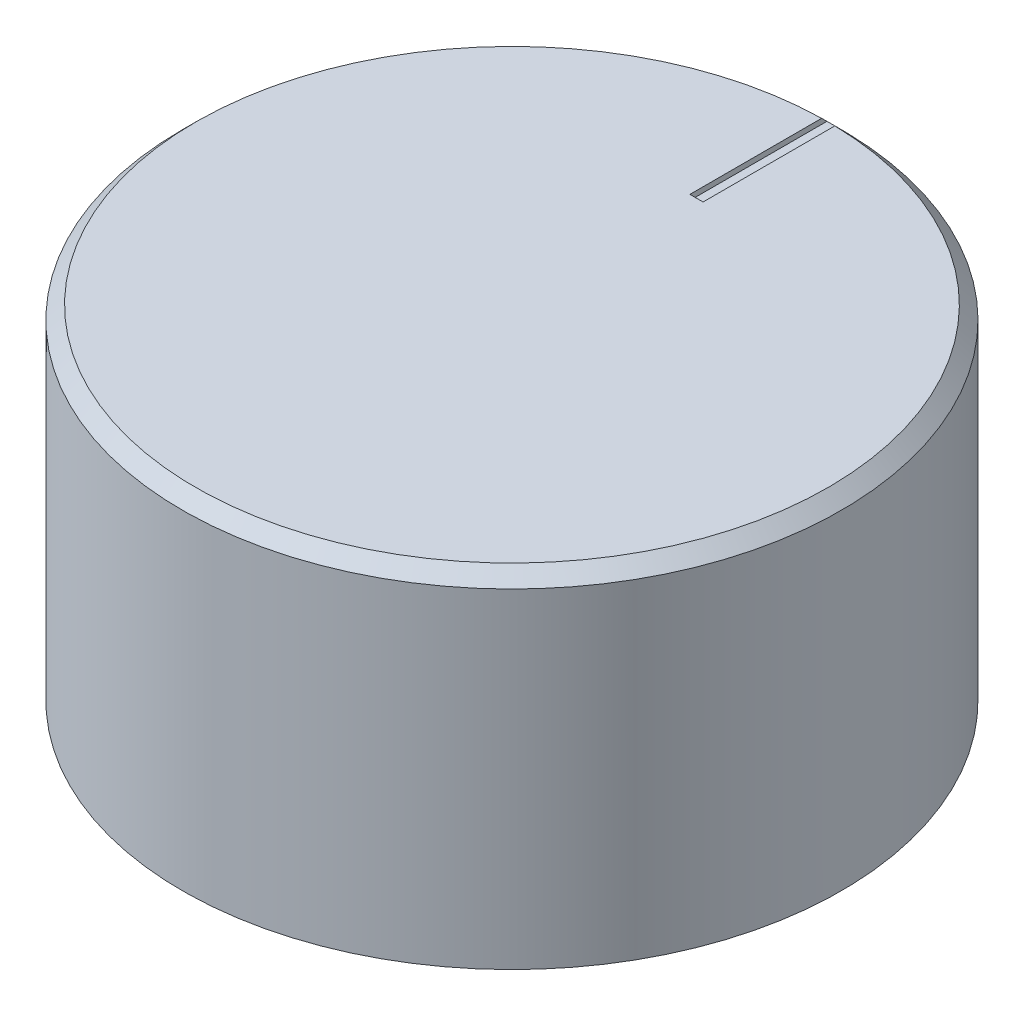
ISO-10303-21;
HEADER;
FILE_DESCRIPTION(('STEP AP214'),'2;1');
FILE_NAME('part.step','',(''),(''),'','','');
FILE_SCHEMA(('AUTOMOTIVE_DESIGN { 1 0 10303 214 1 1 1 1 }'));
ENDSEC;
DATA;
#1=APPLICATION_CONTEXT('core data for automotive mechanical design processes');
#2=APPLICATION_PROTOCOL_DEFINITION('international standard','automotive_design',2000,#1);
#3=PRODUCT_CONTEXT('',#1,'mechanical');
#4=PRODUCT('Part','Part','',(#3));
#5=PRODUCT_RELATED_PRODUCT_CATEGORY('part','',(#4));
#6=PRODUCT_DEFINITION_FORMATION('','',#4);
#7=PRODUCT_DEFINITION_CONTEXT('part definition',#1,'design');
#8=PRODUCT_DEFINITION('design','',#6,#7);
#9=PRODUCT_DEFINITION_SHAPE('','',#8);
#10=(LENGTH_UNIT() NAMED_UNIT(*) SI_UNIT(.MILLI.,.METRE.));
#11=(NAMED_UNIT(*) PLANE_ANGLE_UNIT() SI_UNIT($,.RADIAN.));
#12=(NAMED_UNIT(*) SI_UNIT($,.STERADIAN.) SOLID_ANGLE_UNIT());
#13=UNCERTAINTY_MEASURE_WITH_UNIT(LENGTH_MEASURE(1.E-05),#10,'distance_accuracy_value','');
#14=(GEOMETRIC_REPRESENTATION_CONTEXT(3) GLOBAL_UNCERTAINTY_ASSIGNED_CONTEXT((#13)) GLOBAL_UNIT_ASSIGNED_CONTEXT((#10,
#11,#12)) REPRESENTATION_CONTEXT('',''));
#15=CARTESIAN_POINT('',(0.,0.,0.));
#16=DIRECTION('',(0.,0.,1.));
#17=DIRECTION('',(1.,0.,0.));
#18=AXIS2_PLACEMENT_3D('',#15,#16,#17);
#19=CARTESIAN_POINT('',(0.,12.8,0.));
#20=DIRECTION('',(0.,-1.,0.));
#21=DIRECTION('',(0.,0.,-1.));
#22=AXIS2_PLACEMENT_3D('',#19,#20,#21);
#23=PLANE('',#22);
#24=DIRECTION('',(0.,0.,1.));
#25=VECTOR('',#24,1.);
#26=CARTESIAN_POINT('',(0.249999999999997,12.8,-13.0578940556669));
#27=LINE('',#26,#25);
#28=CARTESIAN_POINT('',(0.249999999999997,12.8,-12.1974382556338));
#29=VERTEX_POINT('',#28);
#30=CARTESIAN_POINT('',(0.249999999999998,12.8,-7.));
#31=VERTEX_POINT('',#30);
#32=EDGE_CURVE('E97',#29,#31,#27,.T.);
#33=ORIENTED_EDGE('',*,*,#32,.F.);
#34=CARTESIAN_POINT('',(0.,12.8,0.));
#35=DIRECTION('',(0.,-1.,0.));
#36=DIRECTION('',(0.,0.,-1.));
#37=AXIS2_PLACEMENT_3D('',#34,#35,#36);
#38=CIRCLE('',#37,12.2);
#39=CARTESIAN_POINT('',(-0.250000000000003,12.8,-12.1974382556338));
#40=VERTEX_POINT('',#39);
#41=EDGE_CURVE('E56',#29,#40,#38,.F.);
#42=ORIENTED_EDGE('',*,*,#41,.T.);
#43=DIRECTION('',(0.,0.,1.));
#44=VECTOR('',#43,1.);
#45=CARTESIAN_POINT('',(-0.250000000000003,12.8,-13.0578940556669));
#46=LINE('',#45,#44);
#47=CARTESIAN_POINT('',(-0.250000000000002,12.8,-7.));
#48=VERTEX_POINT('',#47);
#49=EDGE_CURVE('E138',#40,#48,#46,.T.);
#50=ORIENTED_EDGE('',*,*,#49,.T.);
#51=DIRECTION('',(1.,0.,0.));
#52=VECTOR('',#51,1.);
#53=CARTESIAN_POINT('',(-0.250000000000002,12.8,-7.));
#54=LINE('',#53,#52);
#55=EDGE_CURVE('E122',#48,#31,#54,.T.);
#56=ORIENTED_EDGE('',*,*,#55,.T.);
#57=EDGE_LOOP('',(#33,#42,#50,#56));
#58=FACE_BOUND('',#57,.T.);
#59=ADVANCED_FACE('F37',(#58),#23,.F.);
#60=CARTESIAN_POINT('',(0.,9.,0.));
#61=DIRECTION('',(0.,1.,0.));
#62=DIRECTION('',(-1.,0.,0.));
#63=AXIS2_PLACEMENT_3D('',#60,#61,#62);
#64=PLANE('',#63);
#65=CARTESIAN_POINT('',(0.,9.,0.));
#66=DIRECTION('',(0.,1.,0.));
#67=DIRECTION('',(-1.,0.,0.));
#68=AXIS2_PLACEMENT_3D('',#65,#66,#67);
#69=CIRCLE('',#68,2.5);
#70=CARTESIAN_POINT('',(-2.5,9.,0.));
#71=VERTEX_POINT('',#70);
#72=EDGE_CURVE('E99',#71,#71,#69,.F.);
#73=ORIENTED_EDGE('',*,*,#72,.T.);
#74=EDGE_LOOP('',(#73));
#75=FACE_BOUND('',#74,.T.);
#76=ADVANCED_FACE('F149',(#75),#64,.F.);
#77=CARTESIAN_POINT('',(-0.250000000000003,12.8,-13.0578940556669));
#78=DIRECTION('',(-1.,0.,0.));
#79=DIRECTION('',(0.,0.,1.));
#80=AXIS2_PLACEMENT_3D('',#77,#78,#79);
#81=PLANE('',#80);
#82=ORIENTED_EDGE('',*,*,#49,.F.);
#83=CARTESIAN_POINT('',(-0.250000000000003,12.8,-12.1974382556338));
#84=CARTESIAN_POINT('',(-0.250000000000003,13.4482690990723,-11.5490450974811));
#85=CARTESIAN_POINT('',(-0.250000000000003,14.0965192367073,-10.9006329837363));
#86=CARTESIAN_POINT('',(-0.250000000000003,15.3929815893128,-9.60377084485224));
#87=CARTESIAN_POINT('',(-0.250000000000003,16.0411938042832,-8.95532081971295));
#88=CARTESIAN_POINT('',(-0.250000000000003,16.6893870578163,-8.30685183898155));
#89=B_SPLINE_CURVE_WITH_KNOTS('',3,(#83,#84,#85,#86,#87,#88),.UNSPECIFIED.,.F.,.F.,(4,2,4),(0.,
2.75063603403886,5.50127206896976),.UNSPECIFIED.);
#90=CARTESIAN_POINT('',(-0.250000000000004,13.,-11.9973955507018));
#91=VERTEX_POINT('',#90);
#92=EDGE_CURVE('E46',#40,#91,#89,.T.);
#93=ORIENTED_EDGE('',*,*,#92,.T.);
#94=DIRECTION('',(0.,0.,1.));
#95=VECTOR('',#94,1.);
#96=CARTESIAN_POINT('',(-0.250000000000004,13.,0.));
#97=LINE('',#96,#95);
#98=CARTESIAN_POINT('',(-0.250000000000003,13.,-7.));
#99=VERTEX_POINT('',#98);
#100=EDGE_CURVE('E92',#91,#99,#97,.T.);
#101=ORIENTED_EDGE('',*,*,#100,.T.);
#102=DIRECTION('',(0.,1.,0.));
#103=VECTOR('',#102,1.);
#104=CARTESIAN_POINT('',(-0.250000000000002,12.8,-7.));
#105=LINE('',#104,#103);
#106=EDGE_CURVE('E87',#99,#48,#105,.F.);
#107=ORIENTED_EDGE('',*,*,#106,.T.);
#108=EDGE_LOOP('',(#82,#93,#101,#107));
#109=FACE_BOUND('',#108,.T.);
#110=ADVANCED_FACE('F144',(#109),#81,.F.);
#111=CARTESIAN_POINT('',(-0.250000000000002,12.8,-7.));
#112=DIRECTION('',(0.,0.,1.));
#113=DIRECTION('',(1.,0.,0.));
#114=AXIS2_PLACEMENT_3D('',#111,#112,#113);
#115=PLANE('',#114);
#116=DIRECTION('',(0.,1.,0.));
#117=VECTOR('',#116,1.);
#118=CARTESIAN_POINT('',(0.249999999999998,12.8,-7.));
#119=LINE('',#118,#117);
#120=CARTESIAN_POINT('',(0.249999999999997,13.,-7.));
#121=VERTEX_POINT('',#120);
#122=EDGE_CURVE('E85',#31,#121,#119,.T.);
#123=ORIENTED_EDGE('',*,*,#122,.F.);
#124=ORIENTED_EDGE('',*,*,#55,.F.);
#125=ORIENTED_EDGE('',*,*,#106,.F.);
#126=DIRECTION('',(1.,0.,0.));
#127=VECTOR('',#126,1.);
#128=CARTESIAN_POINT('',(12.5,13.,-7.));
#129=LINE('',#128,#127);
#130=EDGE_CURVE('E81',#99,#121,#129,.T.);
#131=ORIENTED_EDGE('',*,*,#130,.T.);
#132=EDGE_LOOP('',(#123,#124,#125,#131));
#133=FACE_BOUND('',#132,.T.);
#134=ADVANCED_FACE('F83',(#133),#115,.F.);
#135=CARTESIAN_POINT('',(0.249999999999997,12.8,-13.0578940556669));
#136=DIRECTION('',(-1.,0.,0.));
#137=DIRECTION('',(0.,0.,1.));
#138=AXIS2_PLACEMENT_3D('',#135,#136,#137);
#139=PLANE('',#138);
#140=DIRECTION('',(0.,0.,1.));
#141=VECTOR('',#140,1.);
#142=CARTESIAN_POINT('',(0.249999999999997,13.,0.));
#143=LINE('',#142,#141);
#144=CARTESIAN_POINT('',(0.249999999999997,13.,-11.9973955507018));
#145=VERTEX_POINT('',#144);
#146=EDGE_CURVE('E91',#121,#145,#143,.F.);
#147=ORIENTED_EDGE('',*,*,#146,.T.);
#148=CARTESIAN_POINT('',(0.249999999999997,13.,-11.9973955507018));
#149=CARTESIAN_POINT('',(0.249999999999997,12.3517368340844,-12.6457946380684));
#150=CARTESIAN_POINT('',(0.249999999999997,11.7034662555647,-13.2941863140457));
#151=CARTESIAN_POINT('',(0.249999999999997,10.4069102733406,-14.5909548431985));
#152=CARTESIAN_POINT('',(0.249999999999997,9.7586248696363,-15.239331696374));
#153=CARTESIAN_POINT('',(0.249999999999997,9.11033205332788,-15.8877011381603));
#154=B_SPLINE_CURVE_WITH_KNOTS('',3,(#148,#149,#150,#151,#152,#153),.UNSPECIFIED.,.F.,.F.,(4,2,
4),(0.,2.75063603118614,5.501272062272),.UNSPECIFIED.);
#155=EDGE_CURVE('E119',#145,#29,#154,.T.);
#156=ORIENTED_EDGE('',*,*,#155,.T.);
#157=ORIENTED_EDGE('',*,*,#32,.T.);
#158=ORIENTED_EDGE('',*,*,#122,.T.);
#159=EDGE_LOOP('',(#147,#156,#157,#158));
#160=FACE_BOUND('',#159,.T.);
#161=ADVANCED_FACE('F96',(#160),#139,.T.);
#162=CARTESIAN_POINT('',(0.,13.,0.));
#163=DIRECTION('',(0.,1.,0.));
#164=DIRECTION('',(-1.,0.,0.));
#165=AXIS2_PLACEMENT_3D('',#162,#163,#164);
#166=CYLINDRICAL_SURFACE('',#165,2.5);
#167=ORIENTED_EDGE('',*,*,#72,.F.);
#168=EDGE_LOOP('',(#167));
#169=FACE_BOUND('',#168,.T.);
#170=CARTESIAN_POINT('',(0.,0.,0.));
#171=DIRECTION('',(0.,1.,0.));
#172=DIRECTION('',(-1.,0.,0.));
#173=AXIS2_PLACEMENT_3D('',#170,#171,#172);
#174=CIRCLE('',#173,2.5);
#175=CARTESIAN_POINT('',(-2.5,0.,0.));
#176=VERTEX_POINT('',#175);
#177=EDGE_CURVE('E105',#176,#176,#174,.F.);
#178=ORIENTED_EDGE('',*,*,#177,.T.);
#179=EDGE_LOOP('',(#178));
#180=FACE_BOUND('',#179,.T.);
#181=ADVANCED_FACE('F172',(#169,#180),#166,.F.);
#182=CARTESIAN_POINT('',(12.5,13.,0.));
#183=DIRECTION('',(0.,-1.,0.));
#184=DIRECTION('',(1.,0.,0.));
#185=AXIS2_PLACEMENT_3D('',#182,#183,#184);
#186=PLANE('',#185);
#187=ORIENTED_EDGE('',*,*,#100,.F.);
#188=CARTESIAN_POINT('',(0.,13.,0.));
#189=DIRECTION('',(0.,-1.,0.));
#190=DIRECTION('',(1.,0.,0.));
#191=AXIS2_PLACEMENT_3D('',#188,#189,#190);
#192=CIRCLE('',#191,12.);
#193=EDGE_CURVE('E104',#91,#145,#192,.F.);
#194=ORIENTED_EDGE('',*,*,#193,.T.);
#195=ORIENTED_EDGE('',*,*,#146,.F.);
#196=ORIENTED_EDGE('',*,*,#130,.F.);
#197=EDGE_LOOP('',(#187,#194,#195,#196));
#198=FACE_BOUND('',#197,.T.);
#199=ADVANCED_FACE('F102',(#198),#186,.F.);
#200=CARTESIAN_POINT('',(2.5,0.,0.));
#201=DIRECTION('',(0.,1.,0.));
#202=DIRECTION('',(-1.,0.,0.));
#203=AXIS2_PLACEMENT_3D('',#200,#201,#202);
#204=PLANE('',#203);
#205=ORIENTED_EDGE('',*,*,#177,.F.);
#206=EDGE_LOOP('',(#205));
#207=FACE_BOUND('',#206,.T.);
#208=CARTESIAN_POINT('',(0.,0.,0.));
#209=DIRECTION('',(0.,1.,0.));
#210=DIRECTION('',(-1.,0.,0.));
#211=AXIS2_PLACEMENT_3D('',#208,#209,#210);
#212=CIRCLE('',#211,12.5);
#213=CARTESIAN_POINT('',(-12.5,0.,0.));
#214=VERTEX_POINT('',#213);
#215=EDGE_CURVE('E108',#214,#214,#212,.T.);
#216=ORIENTED_EDGE('',*,*,#215,.F.);
#217=EDGE_LOOP('',(#216));
#218=FACE_BOUND('',#217,.T.);
#219=ADVANCED_FACE('F160',(#207,#218),#204,.F.);
#220=CARTESIAN_POINT('',(0.,13.,0.));
#221=DIRECTION('',(0.,1.,0.));
#222=DIRECTION('',(-1.,0.,0.));
#223=AXIS2_PLACEMENT_3D('',#220,#221,#222);
#224=CYLINDRICAL_SURFACE('',#223,12.5);
#225=CARTESIAN_POINT('',(0.,12.5,0.));
#226=DIRECTION('',(0.,-1.,0.));
#227=DIRECTION('',(1.,0.,0.));
#228=AXIS2_PLACEMENT_3D('',#225,#226,#227);
#229=CIRCLE('',#228,12.5);
#230=CARTESIAN_POINT('',(-0.26041666666667,12.5,-12.4972870319811));
#231=VERTEX_POINT('',#230);
#232=EDGE_CURVE('E11',#231,#231,#229,.T.);
#233=ORIENTED_EDGE('',*,*,#232,.T.);
#234=EDGE_LOOP('',(#233));
#235=FACE_BOUND('',#234,.T.);
#236=ORIENTED_EDGE('',*,*,#215,.T.);
#237=EDGE_LOOP('',(#236));
#238=FACE_BOUND('',#237,.T.);
#239=ADVANCED_FACE('F158',(#235,#238),#224,.T.);
#240=CARTESIAN_POINT('',(0.,13.,0.));
#241=DIRECTION('',(0.,-1.,0.));
#242=DIRECTION('',(1.,0.,0.));
#243=AXIS2_PLACEMENT_3D('',#240,#241,#242);
#244=CONICAL_SURFACE('',#243,12.,0.785398163397448);
#245=ORIENTED_EDGE('',*,*,#232,.F.);
#246=EDGE_LOOP('',(#245));
#247=FACE_BOUND('',#246,.T.);
#248=ORIENTED_EDGE('',*,*,#155,.F.);
#249=ORIENTED_EDGE('',*,*,#193,.F.);
#250=ORIENTED_EDGE('',*,*,#92,.F.);
#251=ORIENTED_EDGE('',*,*,#41,.F.);
#252=EDGE_LOOP('',(#248,#249,#250,#251));
#253=FACE_BOUND('',#252,.T.);
#254=ADVANCED_FACE('F39',(#247,#253),#244,.T.);
#255=CLOSED_SHELL('',(#59,#76,#110,#134,#161,#181,#199,#219,#239,#254));
#256=MANIFOLD_SOLID_BREP('B2',#255);
#257=ADVANCED_BREP_SHAPE_REPRESENTATION('',(#18,#256),#14);
#258=SHAPE_DEFINITION_REPRESENTATION(#9,#257);
ENDSEC;
END-ISO-10303-21;
